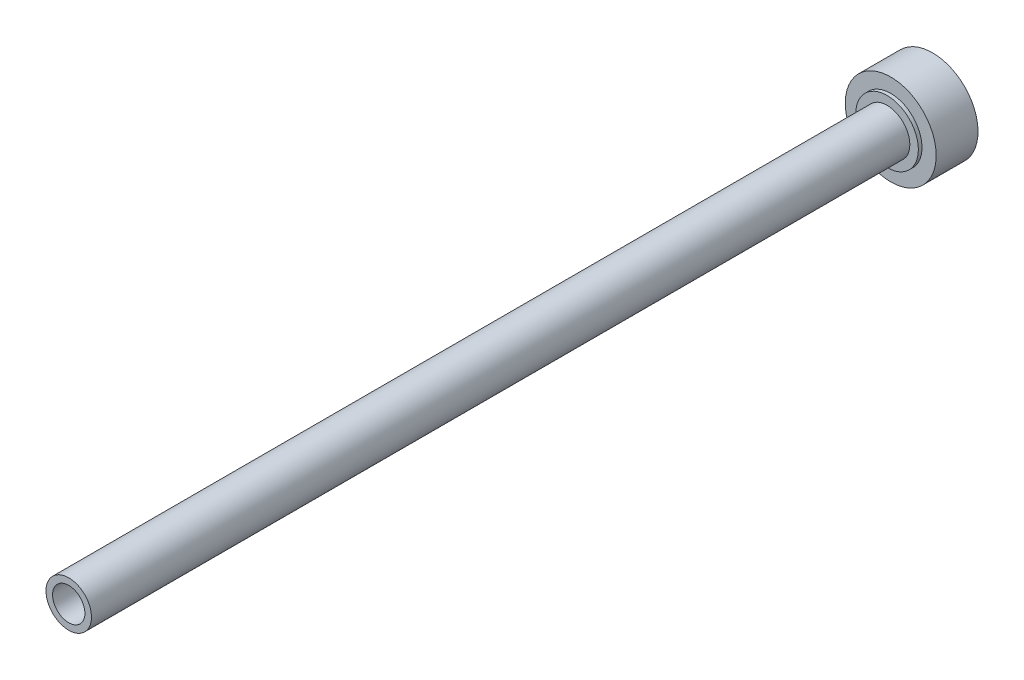
ISO-10303-21;
HEADER;
FILE_DESCRIPTION(('STEP AP214'),'2;1');
FILE_NAME('part.step','',(''),(''),'','','');
FILE_SCHEMA(('AUTOMOTIVE_DESIGN { 1 0 10303 214 1 1 1 1 }'));
ENDSEC;
DATA;
#1=APPLICATION_CONTEXT('core data for automotive mechanical design processes');
#2=APPLICATION_PROTOCOL_DEFINITION('international standard','automotive_design',2000,#1);
#3=PRODUCT_CONTEXT('',#1,'mechanical');
#4=PRODUCT('Part','Part','',(#3));
#5=PRODUCT_RELATED_PRODUCT_CATEGORY('part','',(#4));
#6=PRODUCT_DEFINITION_FORMATION('','',#4);
#7=PRODUCT_DEFINITION_CONTEXT('part definition',#1,'design');
#8=PRODUCT_DEFINITION('design','',#6,#7);
#9=PRODUCT_DEFINITION_SHAPE('','',#8);
#10=(LENGTH_UNIT() NAMED_UNIT(*) SI_UNIT(.MILLI.,.METRE.));
#11=(NAMED_UNIT(*) PLANE_ANGLE_UNIT() SI_UNIT($,.RADIAN.));
#12=(NAMED_UNIT(*) SI_UNIT($,.STERADIAN.) SOLID_ANGLE_UNIT());
#13=UNCERTAINTY_MEASURE_WITH_UNIT(LENGTH_MEASURE(1.E-05),#10,'distance_accuracy_value','');
#14=(GEOMETRIC_REPRESENTATION_CONTEXT(3) GLOBAL_UNCERTAINTY_ASSIGNED_CONTEXT((#13)) GLOBAL_UNIT_ASSIGNED_CONTEXT((#10,
#11,#12)) REPRESENTATION_CONTEXT('',''));
#15=CARTESIAN_POINT('',(0.,0.,0.));
#16=DIRECTION('',(0.,0.,1.));
#17=DIRECTION('',(1.,0.,0.));
#18=AXIS2_PLACEMENT_3D('',#15,#16,#17);
#19=CARTESIAN_POINT('',(0.,0.,28.575));
#20=DIRECTION('',(0.,0.,1.));
#21=DIRECTION('',(0.,-1.,0.));
#22=AXIS2_PLACEMENT_3D('',#19,#20,#21);
#23=CYLINDRICAL_SURFACE('',#22,1.5875);
#24=CARTESIAN_POINT('',(0.,0.,28.575));
#25=DIRECTION('',(0.,0.,1.));
#26=DIRECTION('',(0.,-1.,0.));
#27=AXIS2_PLACEMENT_3D('',#24,#25,#26);
#28=CIRCLE('',#27,1.5875);
#29=CARTESIAN_POINT('',(0.,-1.58750000000001,28.575));
#30=VERTEX_POINT('',#29);
#31=EDGE_CURVE('E11',#30,#30,#28,.T.);
#32=ORIENTED_EDGE('',*,*,#31,.F.);
#33=EDGE_LOOP('',(#32));
#34=FACE_BOUND('',#33,.T.);
#35=CARTESIAN_POINT('',(0.,0.,-28.575));
#36=DIRECTION('',(0.,0.,1.));
#37=DIRECTION('',(0.,-1.,0.));
#38=AXIS2_PLACEMENT_3D('',#35,#36,#37);
#39=CIRCLE('',#38,1.5875);
#40=CARTESIAN_POINT('',(0.,-1.5875,-28.575));
#41=VERTEX_POINT('',#40);
#42=EDGE_CURVE('E56',#41,#41,#39,.T.);
#43=ORIENTED_EDGE('',*,*,#42,.T.);
#44=EDGE_LOOP('',(#43));
#45=FACE_BOUND('',#44,.T.);
#46=ADVANCED_FACE('F37',(#34,#45),#23,.T.);
#47=CARTESIAN_POINT('',(0.,0.,28.575));
#48=DIRECTION('',(0.,0.,-1.));
#49=DIRECTION('',(0.,1.,0.));
#50=AXIS2_PLACEMENT_3D('',#47,#48,#49);
#51=PLANE('',#50);
#52=CARTESIAN_POINT('',(0.,0.,28.575));
#53=DIRECTION('',(0.,0.,1.));
#54=DIRECTION('',(1.,0.,0.));
#55=AXIS2_PLACEMENT_3D('',#52,#53,#54);
#56=CIRCLE('',#55,1.13029999999999);
#57=CARTESIAN_POINT('',(1.13029999999999,0.,28.575));
#58=VERTEX_POINT('',#57);
#59=EDGE_CURVE('E57',#58,#58,#56,.T.);
#60=ORIENTED_EDGE('',*,*,#59,.F.);
#61=EDGE_LOOP('',(#60));
#62=FACE_BOUND('',#61,.T.);
#63=ORIENTED_EDGE('',*,*,#31,.T.);
#64=EDGE_LOOP('',(#63));
#65=FACE_BOUND('',#64,.T.);
#66=ADVANCED_FACE('F80',(#62,#65),#51,.F.);
#67=CARTESIAN_POINT('',(0.,0.,-31.75));
#68=DIRECTION('',(0.,0.,-1.));
#69=DIRECTION('',(0.,1.,0.));
#70=AXIS2_PLACEMENT_3D('',#67,#68,#69);
#71=PLANE('',#70);
#72=CARTESIAN_POINT('',(0.,0.,-31.75));
#73=DIRECTION('',(0.,0.,1.));
#74=DIRECTION('',(0.,-1.,0.));
#75=AXIS2_PLACEMENT_3D('',#72,#73,#74);
#76=CIRCLE('',#75,3.17499999999999);
#77=CARTESIAN_POINT('',(0.,-3.17499999999999,-31.75));
#78=VERTEX_POINT('',#77);
#79=EDGE_CURVE('E43',#78,#78,#76,.T.);
#80=ORIENTED_EDGE('',*,*,#79,.F.);
#81=EDGE_LOOP('',(#80));
#82=FACE_BOUND('',#81,.T.);
#83=ADVANCED_FACE('F78',(#82),#71,.T.);
#84=CARTESIAN_POINT('',(0.,0.,28.575));
#85=DIRECTION('',(0.,0.,1.));
#86=DIRECTION('',(0.,-1.,0.));
#87=AXIS2_PLACEMENT_3D('',#84,#85,#86);
#88=CYLINDRICAL_SURFACE('',#87,3.175);
#89=ORIENTED_EDGE('',*,*,#79,.T.);
#90=EDGE_LOOP('',(#89));
#91=FACE_BOUND('',#90,.T.);
#92=CARTESIAN_POINT('',(0.,0.,-28.829));
#93=DIRECTION('',(0.,0.,1.));
#94=DIRECTION('',(0.,-1.,0.));
#95=AXIS2_PLACEMENT_3D('',#92,#93,#94);
#96=CIRCLE('',#95,3.175);
#97=CARTESIAN_POINT('',(0.,-3.17499999999999,-28.829));
#98=VERTEX_POINT('',#97);
#99=EDGE_CURVE('E70',#98,#98,#96,.T.);
#100=ORIENTED_EDGE('',*,*,#99,.F.);
#101=EDGE_LOOP('',(#100));
#102=FACE_BOUND('',#101,.T.);
#103=ADVANCED_FACE('F75',(#91,#102),#88,.T.);
#104=CARTESIAN_POINT('',(0.,0.,-28.829));
#105=DIRECTION('',(0.,0.,1.));
#106=DIRECTION('',(0.,-1.,0.));
#107=AXIS2_PLACEMENT_3D('',#104,#105,#106);
#108=PLANE('',#107);
#109=ORIENTED_EDGE('',*,*,#99,.T.);
#110=EDGE_LOOP('',(#109));
#111=FACE_BOUND('',#110,.T.);
#112=CARTESIAN_POINT('',(0.,0.,-28.829));
#113=DIRECTION('',(0.,0.,1.));
#114=DIRECTION('',(0.,-1.,0.));
#115=AXIS2_PLACEMENT_3D('',#112,#113,#114);
#116=CIRCLE('',#115,2.1828125);
#117=CARTESIAN_POINT('',(0.,-2.18281249999999,-28.829));
#118=VERTEX_POINT('',#117);
#119=EDGE_CURVE('E67',#118,#118,#116,.T.);
#120=ORIENTED_EDGE('',*,*,#119,.F.);
#121=EDGE_LOOP('',(#120));
#122=FACE_BOUND('',#121,.T.);
#123=ADVANCED_FACE('F86',(#111,#122),#108,.T.);
#124=CARTESIAN_POINT('',(0.,0.,28.575));
#125=DIRECTION('',(0.,0.,1.));
#126=DIRECTION('',(0.,-1.,0.));
#127=AXIS2_PLACEMENT_3D('',#124,#125,#126);
#128=CYLINDRICAL_SURFACE('',#127,2.1828125);
#129=ORIENTED_EDGE('',*,*,#119,.T.);
#130=EDGE_LOOP('',(#129));
#131=FACE_BOUND('',#130,.T.);
#132=CARTESIAN_POINT('',(0.,0.,-28.575));
#133=DIRECTION('',(0.,0.,1.));
#134=DIRECTION('',(0.,-1.,0.));
#135=AXIS2_PLACEMENT_3D('',#132,#133,#134);
#136=CIRCLE('',#135,2.1828125);
#137=CARTESIAN_POINT('',(0.,-2.18281249999999,-28.575));
#138=VERTEX_POINT('',#137);
#139=EDGE_CURVE('E60',#138,#138,#136,.T.);
#140=ORIENTED_EDGE('',*,*,#139,.F.);
#141=EDGE_LOOP('',(#140));
#142=FACE_BOUND('',#141,.T.);
#143=ADVANCED_FACE('F98',(#131,#142),#128,.T.);
#144=CARTESIAN_POINT('',(0.,0.,-28.575));
#145=DIRECTION('',(0.,0.,1.));
#146=DIRECTION('',(0.,-1.,0.));
#147=AXIS2_PLACEMENT_3D('',#144,#145,#146);
#148=PLANE('',#147);
#149=ORIENTED_EDGE('',*,*,#139,.T.);
#150=EDGE_LOOP('',(#149));
#151=FACE_BOUND('',#150,.T.);
#152=ORIENTED_EDGE('',*,*,#42,.F.);
#153=EDGE_LOOP('',(#152));
#154=FACE_BOUND('',#153,.T.);
#155=ADVANCED_FACE('F50',(#151,#154),#148,.T.);
#156=CARTESIAN_POINT('',(0.,0.,20.955));
#157=DIRECTION('',(0.,0.,1.));
#158=DIRECTION('',(1.,0.,0.));
#159=AXIS2_PLACEMENT_3D('',#156,#157,#158);
#160=CONICAL_SURFACE('',#159,1.13029999999999,1.02974425867665);
#161=CARTESIAN_POINT('',(0.,0.,20.2758472423131));
#162=VERTEX_POINT('',#161);
#163=VERTEX_LOOP('',#162);
#164=FACE_BOUND('',#163,.T.);
#165=CARTESIAN_POINT('',(0.,0.,20.955));
#166=DIRECTION('',(0.,0.,1.));
#167=DIRECTION('',(1.,0.,0.));
#168=AXIS2_PLACEMENT_3D('',#165,#166,#167);
#169=CIRCLE('',#168,1.13029999999999);
#170=CARTESIAN_POINT('',(1.13029999999999,0.,20.955));
#171=VERTEX_POINT('',#170);
#172=EDGE_CURVE('E54',#171,#171,#169,.T.);
#173=ORIENTED_EDGE('',*,*,#172,.T.);
#174=EDGE_LOOP('',(#173));
#175=FACE_BOUND('',#174,.T.);
#176=ADVANCED_FACE('F46',(#164,#175),#160,.F.);
#177=CARTESIAN_POINT('',(0.,0.,28.575));
#178=DIRECTION('',(0.,0.,1.));
#179=DIRECTION('',(1.,0.,0.));
#180=AXIS2_PLACEMENT_3D('',#177,#178,#179);
#181=CYLINDRICAL_SURFACE('',#180,1.13029999999999);
#182=ORIENTED_EDGE('',*,*,#172,.F.);
#183=EDGE_LOOP('',(#182));
#184=FACE_BOUND('',#183,.T.);
#185=ORIENTED_EDGE('',*,*,#59,.T.);
#186=EDGE_LOOP('',(#185));
#187=FACE_BOUND('',#186,.T.);
#188=ADVANCED_FACE('F49',(#184,#187),#181,.F.);
#189=CLOSED_SHELL('',(#46,#66,#83,#103,#123,#143,#155,#176,#188));
#190=MANIFOLD_SOLID_BREP('B2',#189);
#191=ADVANCED_BREP_SHAPE_REPRESENTATION('',(#18,#190),#14);
#192=SHAPE_DEFINITION_REPRESENTATION(#9,#191);
ENDSEC;
END-ISO-10303-21;
